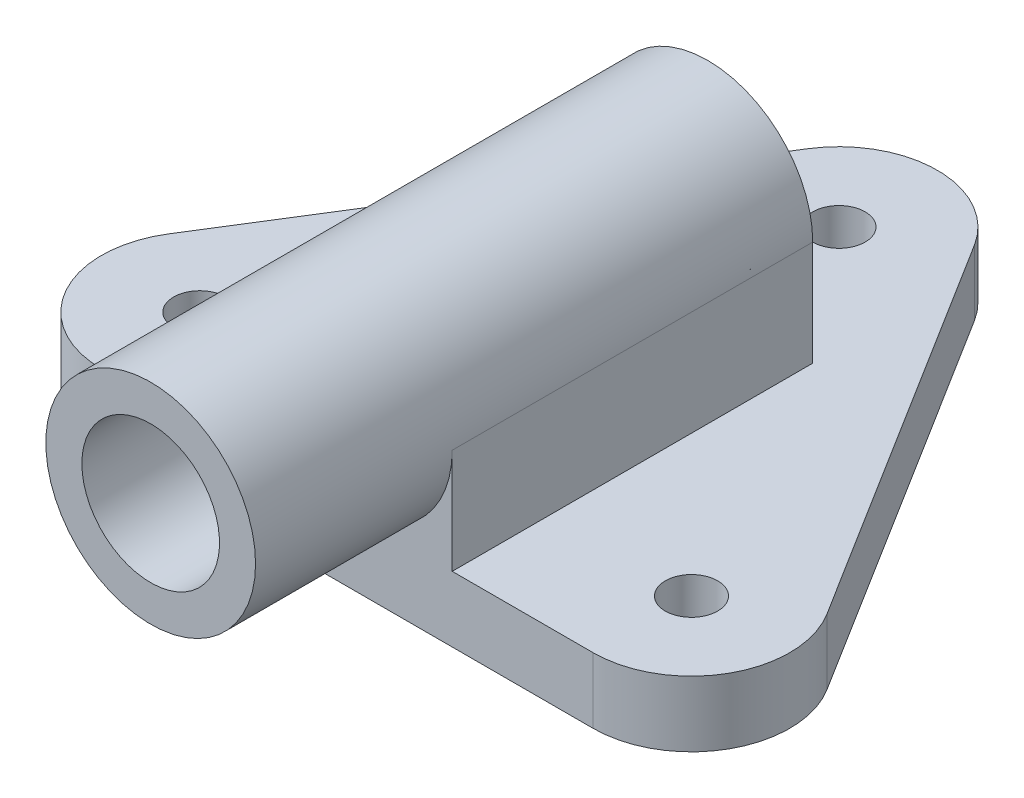
ISO-10303-21;
HEADER;
FILE_DESCRIPTION(('STEP AP214'),'2;1');
FILE_NAME('part.step','',(''),(''),'','','');
FILE_SCHEMA(('AUTOMOTIVE_DESIGN { 1 0 10303 214 1 1 1 1 }'));
ENDSEC;
DATA;
#1=APPLICATION_CONTEXT('core data for automotive mechanical design processes');
#2=APPLICATION_PROTOCOL_DEFINITION('international standard','automotive_design',2000,#1);
#3=PRODUCT_CONTEXT('',#1,'mechanical');
#4=PRODUCT('Part','Part','',(#3));
#5=PRODUCT_RELATED_PRODUCT_CATEGORY('part','',(#4));
#6=PRODUCT_DEFINITION_FORMATION('','',#4);
#7=PRODUCT_DEFINITION_CONTEXT('part definition',#1,'design');
#8=PRODUCT_DEFINITION('design','',#6,#7);
#9=PRODUCT_DEFINITION_SHAPE('','',#8);
#10=(LENGTH_UNIT() NAMED_UNIT(*) SI_UNIT(.MILLI.,.METRE.));
#11=(NAMED_UNIT(*) PLANE_ANGLE_UNIT() SI_UNIT($,.RADIAN.));
#12=(NAMED_UNIT(*) SI_UNIT($,.STERADIAN.) SOLID_ANGLE_UNIT());
#13=UNCERTAINTY_MEASURE_WITH_UNIT(LENGTH_MEASURE(1.E-05),#10,'distance_accuracy_value','');
#14=(GEOMETRIC_REPRESENTATION_CONTEXT(3) GLOBAL_UNCERTAINTY_ASSIGNED_CONTEXT((#13)) GLOBAL_UNIT_ASSIGNED_CONTEXT((#10,
#11,#12)) REPRESENTATION_CONTEXT('',''));
#15=CARTESIAN_POINT('',(0.,0.,0.));
#16=DIRECTION('',(0.,0.,1.));
#17=DIRECTION('',(1.,0.,0.));
#18=AXIS2_PLACEMENT_3D('',#15,#16,#17);
#19=CARTESIAN_POINT('',(0.,26.,105.));
#20=DIRECTION('',(0.,0.,1.));
#21=DIRECTION('',(1.,0.,0.));
#22=AXIS2_PLACEMENT_3D('',#19,#20,#21);
#23=PLANE('',#22);
#24=CARTESIAN_POINT('',(0.,26.,105.));
#25=DIRECTION('',(0.,0.,-1.));
#26=DIRECTION('',(-1.,0.,0.));
#27=AXIS2_PLACEMENT_3D('',#24,#25,#26);
#28=CIRCLE('',#27,10.5);
#29=CARTESIAN_POINT('',(-10.5,26.,105.));
#30=VERTEX_POINT('',#29);
#31=EDGE_CURVE('E248',#30,#30,#28,.T.);
#32=ORIENTED_EDGE('',*,*,#31,.T.);
#33=EDGE_LOOP('',(#32));
#34=FACE_BOUND('',#33,.T.);
#35=CARTESIAN_POINT('',(0.,26.,105.));
#36=DIRECTION('',(0.,0.,1.));
#37=DIRECTION('',(1.,0.,0.));
#38=AXIS2_PLACEMENT_3D('',#35,#36,#37);
#39=CIRCLE('',#38,16.);
#40=CARTESIAN_POINT('',(16.,26.,105.));
#41=VERTEX_POINT('',#40);
#42=EDGE_CURVE('E259',#41,#41,#39,.T.);
#43=ORIENTED_EDGE('',*,*,#42,.T.);
#44=EDGE_LOOP('',(#43));
#45=FACE_BOUND('',#44,.T.);
#46=ADVANCED_FACE('F61',(#34,#45),#23,.T.);
#47=CARTESIAN_POINT('',(-16.,10.,105.));
#48=DIRECTION('',(1.,0.,0.));
#49=DIRECTION('',(0.,0.,-1.));
#50=AXIS2_PLACEMENT_3D('',#47,#48,#49);
#51=PLANE('',#50);
#52=DIRECTION('',(0.,-1.,0.));
#53=VECTOR('',#52,1.);
#54=CARTESIAN_POINT('',(-16.,0.,75.));
#55=LINE('',#54,#53);
#56=CARTESIAN_POINT('',(-16.,26.,75.));
#57=VERTEX_POINT('',#56);
#58=CARTESIAN_POINT('',(-16.,10.,75.));
#59=VERTEX_POINT('',#58);
#60=EDGE_CURVE('E139',#57,#59,#55,.T.);
#61=ORIENTED_EDGE('',*,*,#60,.F.);
#62=DIRECTION('',(0.,0.,-1.));
#63=VECTOR('',#62,1.);
#64=CARTESIAN_POINT('',(-16.,26.,105.));
#65=LINE('',#64,#63);
#66=CARTESIAN_POINT('',(-16.,26.,20.));
#67=VERTEX_POINT('',#66);
#68=EDGE_CURVE('E258',#57,#67,#65,.T.);
#69=ORIENTED_EDGE('',*,*,#68,.T.);
#70=DIRECTION('',(0.,-1.,0.));
#71=VECTOR('',#70,1.);
#72=CARTESIAN_POINT('',(-16.,10.,20.));
#73=LINE('',#72,#71);
#74=CARTESIAN_POINT('',(-16.,10.,20.));
#75=VERTEX_POINT('',#74);
#76=EDGE_CURVE('E152',#67,#75,#73,.T.);
#77=ORIENTED_EDGE('',*,*,#76,.T.);
#78=DIRECTION('',(0.,0.,-1.));
#79=VECTOR('',#78,1.);
#80=CARTESIAN_POINT('',(-16.,10.,105.));
#81=LINE('',#80,#79);
#82=EDGE_CURVE('E71',#59,#75,#81,.T.);
#83=ORIENTED_EDGE('',*,*,#82,.F.);
#84=EDGE_LOOP('',(#61,#69,#77,#83));
#85=FACE_BOUND('',#84,.T.);
#86=ADVANCED_FACE('F151',(#85),#51,.F.);
#87=CARTESIAN_POINT('',(16.,26.,105.));
#88=DIRECTION('',(-1.,0.,0.));
#89=DIRECTION('',(0.,0.,1.));
#90=AXIS2_PLACEMENT_3D('',#87,#88,#89);
#91=PLANE('',#90);
#92=DIRECTION('',(0.,1.,0.));
#93=VECTOR('',#92,1.);
#94=CARTESIAN_POINT('',(16.,0.,75.));
#95=LINE('',#94,#93);
#96=CARTESIAN_POINT('',(16.,10.,75.));
#97=VERTEX_POINT('',#96);
#98=CARTESIAN_POINT('',(16.,26.,75.));
#99=VERTEX_POINT('',#98);
#100=EDGE_CURVE('E244',#97,#99,#95,.T.);
#101=ORIENTED_EDGE('',*,*,#100,.F.);
#102=DIRECTION('',(0.,0.,-1.));
#103=VECTOR('',#102,1.);
#104=CARTESIAN_POINT('',(16.,10.,105.));
#105=LINE('',#104,#103);
#106=CARTESIAN_POINT('',(16.,10.,20.));
#107=VERTEX_POINT('',#106);
#108=EDGE_CURVE('E12',#97,#107,#105,.T.);
#109=ORIENTED_EDGE('',*,*,#108,.T.);
#110=DIRECTION('',(0.,1.,0.));
#111=VECTOR('',#110,1.);
#112=CARTESIAN_POINT('',(16.,26.,20.));
#113=LINE('',#112,#111);
#114=CARTESIAN_POINT('',(16.,26.,20.));
#115=VERTEX_POINT('',#114);
#116=EDGE_CURVE('E253',#107,#115,#113,.T.);
#117=ORIENTED_EDGE('',*,*,#116,.T.);
#118=DIRECTION('',(0.,0.,-1.));
#119=VECTOR('',#118,1.);
#120=CARTESIAN_POINT('',(16.,26.,105.));
#121=LINE('',#120,#119);
#122=EDGE_CURVE('E251',#99,#115,#121,.T.);
#123=ORIENTED_EDGE('',*,*,#122,.F.);
#124=EDGE_LOOP('',(#101,#109,#117,#123));
#125=FACE_BOUND('',#124,.T.);
#126=ADVANCED_FACE('F252',(#125),#91,.F.);
#127=CARTESIAN_POINT('',(-37.5,10.,60.));
#128=DIRECTION('',(0.,1.,0.));
#129=DIRECTION('',(0.,0.,1.));
#130=AXIS2_PLACEMENT_3D('',#127,#128,#129);
#131=PLANE('',#130);
#132=ORIENTED_EDGE('',*,*,#108,.F.);
#133=DIRECTION('',(1.,0.,0.));
#134=VECTOR('',#133,1.);
#135=CARTESIAN_POINT('',(37.5,10.,75.));
#136=LINE('',#135,#134);
#137=CARTESIAN_POINT('',(37.5,10.,75.));
#138=VERTEX_POINT('',#137);
#139=EDGE_CURVE('E165',#97,#138,#136,.T.);
#140=ORIENTED_EDGE('',*,*,#139,.T.);
#141=CARTESIAN_POINT('',(37.5,10.,60.));
#142=DIRECTION('',(0.,1.,0.));
#143=DIRECTION('',(0.,0.,1.));
#144=AXIS2_PLACEMENT_3D('',#141,#142,#143);
#145=CIRCLE('',#144,15.);
#146=CARTESIAN_POINT('',(50.2199745600763,10.,52.0500158999523));
#147=VERTEX_POINT('',#146);
#148=EDGE_CURVE('E164',#138,#147,#145,.T.);
#149=ORIENTED_EDGE('',*,*,#148,.T.);
#150=DIRECTION('',(-0.52999894000318,0.,-0.847998304005088));
#151=VECTOR('',#150,1.);
#152=CARTESIAN_POINT('',(12.7199745600763,10.,-7.9499841000477));
#153=LINE('',#152,#151);
#154=CARTESIAN_POINT('',(12.7199745600763,10.,-7.9499841000477));
#155=VERTEX_POINT('',#154);
#156=EDGE_CURVE('E169',#147,#155,#153,.T.);
#157=ORIENTED_EDGE('',*,*,#156,.T.);
#158=CARTESIAN_POINT('',(0.,10.,0.));
#159=DIRECTION('',(0.,1.,0.));
#160=DIRECTION('',(0.,0.,1.));
#161=AXIS2_PLACEMENT_3D('',#158,#159,#160);
#162=CIRCLE('',#161,15.);
#163=CARTESIAN_POINT('',(-12.7199745600763,10.,-7.94998410004769));
#164=VERTEX_POINT('',#163);
#165=EDGE_CURVE('E176',#155,#164,#162,.T.);
#166=ORIENTED_EDGE('',*,*,#165,.T.);
#167=DIRECTION('',(-0.52999894000318,0.,0.847998304005088));
#168=VECTOR('',#167,1.);
#169=CARTESIAN_POINT('',(-50.2199745600763,10.,52.0500158999523));
#170=LINE('',#169,#168);
#171=CARTESIAN_POINT('',(-50.2199745600763,10.,52.0500158999523));
#172=VERTEX_POINT('',#171);
#173=EDGE_CURVE('E179',#164,#172,#170,.T.);
#174=ORIENTED_EDGE('',*,*,#173,.T.);
#175=CARTESIAN_POINT('',(-37.5,10.,60.));
#176=DIRECTION('',(0.,1.,0.));
#177=DIRECTION('',(0.,0.,1.));
#178=AXIS2_PLACEMENT_3D('',#175,#176,#177);
#179=CIRCLE('',#178,15.);
#180=CARTESIAN_POINT('',(-37.5,10.,75.));
#181=VERTEX_POINT('',#180);
#182=EDGE_CURVE('E161',#172,#181,#179,.T.);
#183=ORIENTED_EDGE('',*,*,#182,.T.);
#184=EDGE_CURVE('E144',#181,#59,#136,.T.);
#185=ORIENTED_EDGE('',*,*,#184,.T.);
#186=ORIENTED_EDGE('',*,*,#82,.T.);
#187=DIRECTION('',(1.,0.,0.));
#188=VECTOR('',#187,1.);
#189=CARTESIAN_POINT('',(16.,10.,20.));
#190=LINE('',#189,#188);
#191=EDGE_CURVE('E87',#75,#107,#190,.T.);
#192=ORIENTED_EDGE('',*,*,#191,.T.);
#193=EDGE_LOOP('',(#132,#140,#149,#157,#166,#174,#183,#185,#186,#192));
#194=FACE_BOUND('',#193,.T.);
#195=CARTESIAN_POINT('',(-37.5,10.,60.));
#196=DIRECTION('',(0.,1.,0.));
#197=DIRECTION('',(0.,0.,1.));
#198=AXIS2_PLACEMENT_3D('',#195,#196,#197);
#199=CIRCLE('',#198,4.00000000000001);
#200=CARTESIAN_POINT('',(-37.5,10.,64.));
#201=VERTEX_POINT('',#200);
#202=EDGE_CURVE('E278',#201,#201,#199,.T.);
#203=ORIENTED_EDGE('',*,*,#202,.F.);
#204=EDGE_LOOP('',(#203));
#205=FACE_BOUND('',#204,.T.);
#206=CARTESIAN_POINT('',(0.,10.,0.));
#207=DIRECTION('',(0.,1.,0.));
#208=DIRECTION('',(0.,0.,1.));
#209=AXIS2_PLACEMENT_3D('',#206,#207,#208);
#210=CIRCLE('',#209,4.);
#211=CARTESIAN_POINT('',(0.,10.,4.));
#212=VERTEX_POINT('',#211);
#213=EDGE_CURVE('E188',#212,#212,#210,.T.);
#214=ORIENTED_EDGE('',*,*,#213,.F.);
#215=EDGE_LOOP('',(#214));
#216=FACE_BOUND('',#215,.T.);
#217=CARTESIAN_POINT('',(37.5,10.,60.));
#218=DIRECTION('',(0.,1.,0.));
#219=DIRECTION('',(0.,0.,1.));
#220=AXIS2_PLACEMENT_3D('',#217,#218,#219);
#221=CIRCLE('',#220,4.00000000000001);
#222=CARTESIAN_POINT('',(37.5,10.,64.));
#223=VERTEX_POINT('',#222);
#224=EDGE_CURVE('E270',#223,#223,#221,.T.);
#225=ORIENTED_EDGE('',*,*,#224,.F.);
#226=EDGE_LOOP('',(#225));
#227=FACE_BOUND('',#226,.T.);
#228=ADVANCED_FACE('F158',(#194,#205,#216,#227),#131,.T.);
#229=CARTESIAN_POINT('',(-37.5,0.,60.));
#230=DIRECTION('',(0.,1.,0.));
#231=DIRECTION('',(0.,0.,1.));
#232=AXIS2_PLACEMENT_3D('',#229,#230,#231);
#233=PLANE('',#232);
#234=CARTESIAN_POINT('',(-37.5,0.,60.));
#235=DIRECTION('',(0.,1.,0.));
#236=DIRECTION('',(0.,0.,1.));
#237=AXIS2_PLACEMENT_3D('',#234,#235,#236);
#238=CIRCLE('',#237,15.);
#239=CARTESIAN_POINT('',(-50.2199745600763,0.,52.0500158999523));
#240=VERTEX_POINT('',#239);
#241=CARTESIAN_POINT('',(-37.5,0.,75.));
#242=VERTEX_POINT('',#241);
#243=EDGE_CURVE('E183',#240,#242,#238,.T.);
#244=ORIENTED_EDGE('',*,*,#243,.F.);
#245=DIRECTION('',(-0.52999894000318,0.,0.847998304005088));
#246=VECTOR('',#245,1.);
#247=CARTESIAN_POINT('',(-50.2199745600763,0.,52.0500158999523));
#248=LINE('',#247,#246);
#249=CARTESIAN_POINT('',(-12.7199745600763,0.,-7.94998410004769));
#250=VERTEX_POINT('',#249);
#251=EDGE_CURVE('E200',#250,#240,#248,.T.);
#252=ORIENTED_EDGE('',*,*,#251,.F.);
#253=CARTESIAN_POINT('',(0.,0.,0.));
#254=DIRECTION('',(0.,1.,0.));
#255=DIRECTION('',(0.,0.,1.));
#256=AXIS2_PLACEMENT_3D('',#253,#254,#255);
#257=CIRCLE('',#256,15.);
#258=CARTESIAN_POINT('',(12.7199745600763,0.,-7.9499841000477));
#259=VERTEX_POINT('',#258);
#260=EDGE_CURVE('E197',#259,#250,#257,.T.);
#261=ORIENTED_EDGE('',*,*,#260,.F.);
#262=DIRECTION('',(-0.52999894000318,0.,-0.847998304005088));
#263=VECTOR('',#262,1.);
#264=CARTESIAN_POINT('',(12.7199745600763,0.,-7.9499841000477));
#265=LINE('',#264,#263);
#266=CARTESIAN_POINT('',(50.2199745600763,0.,52.0500158999523));
#267=VERTEX_POINT('',#266);
#268=EDGE_CURVE('E194',#267,#259,#265,.T.);
#269=ORIENTED_EDGE('',*,*,#268,.F.);
#270=CARTESIAN_POINT('',(37.5,0.,60.));
#271=DIRECTION('',(0.,1.,0.));
#272=DIRECTION('',(0.,0.,1.));
#273=AXIS2_PLACEMENT_3D('',#270,#271,#272);
#274=CIRCLE('',#273,15.);
#275=CARTESIAN_POINT('',(37.5,0.,75.));
#276=VERTEX_POINT('',#275);
#277=EDGE_CURVE('E191',#276,#267,#274,.T.);
#278=ORIENTED_EDGE('',*,*,#277,.F.);
#279=DIRECTION('',(1.,0.,0.));
#280=VECTOR('',#279,1.);
#281=CARTESIAN_POINT('',(37.5,0.,75.));
#282=LINE('',#281,#280);
#283=EDGE_CURVE('E187',#242,#276,#282,.T.);
#284=ORIENTED_EDGE('',*,*,#283,.F.);
#285=EDGE_LOOP('',(#244,#252,#261,#269,#278,#284));
#286=FACE_BOUND('',#285,.T.);
#287=CARTESIAN_POINT('',(0.,0.,0.));
#288=DIRECTION('',(0.,1.,0.));
#289=DIRECTION('',(0.,0.,1.));
#290=AXIS2_PLACEMENT_3D('',#287,#288,#289);
#291=CIRCLE('',#290,4.);
#292=CARTESIAN_POINT('',(0.,0.,4.));
#293=VERTEX_POINT('',#292);
#294=EDGE_CURVE('E282',#293,#293,#291,.T.);
#295=ORIENTED_EDGE('',*,*,#294,.T.);
#296=EDGE_LOOP('',(#295));
#297=FACE_BOUND('',#296,.T.);
#298=CARTESIAN_POINT('',(-37.5,0.,60.));
#299=DIRECTION('',(0.,1.,0.));
#300=DIRECTION('',(0.,0.,1.));
#301=AXIS2_PLACEMENT_3D('',#298,#299,#300);
#302=CIRCLE('',#301,4.00000000000001);
#303=CARTESIAN_POINT('',(-37.5,0.,64.));
#304=VERTEX_POINT('',#303);
#305=EDGE_CURVE('E274',#304,#304,#302,.T.);
#306=ORIENTED_EDGE('',*,*,#305,.T.);
#307=EDGE_LOOP('',(#306));
#308=FACE_BOUND('',#307,.T.);
#309=CARTESIAN_POINT('',(37.5,0.,60.));
#310=DIRECTION('',(0.,1.,0.));
#311=DIRECTION('',(0.,0.,1.));
#312=AXIS2_PLACEMENT_3D('',#309,#310,#311);
#313=CIRCLE('',#312,4.00000000000001);
#314=CARTESIAN_POINT('',(37.5,0.,64.));
#315=VERTEX_POINT('',#314);
#316=EDGE_CURVE('E263',#315,#315,#313,.T.);
#317=ORIENTED_EDGE('',*,*,#316,.T.);
#318=EDGE_LOOP('',(#317));
#319=FACE_BOUND('',#318,.T.);
#320=ADVANCED_FACE('F228',(#286,#297,#308,#319),#233,.F.);
#321=CARTESIAN_POINT('',(-37.5,10.,60.));
#322=DIRECTION('',(0.,-1.,0.));
#323=DIRECTION('',(0.,0.,-1.));
#324=AXIS2_PLACEMENT_3D('',#321,#322,#323);
#325=CYLINDRICAL_SURFACE('',#324,15.);
#326=ORIENTED_EDGE('',*,*,#243,.T.);
#327=DIRECTION('',(0.,-1.,0.));
#328=VECTOR('',#327,1.);
#329=CARTESIAN_POINT('',(-37.5,10.,75.));
#330=LINE('',#329,#328);
#331=EDGE_CURVE('E155',#181,#242,#330,.T.);
#332=ORIENTED_EDGE('',*,*,#331,.F.);
#333=ORIENTED_EDGE('',*,*,#182,.F.);
#334=DIRECTION('',(0.,-1.,0.));
#335=VECTOR('',#334,1.);
#336=CARTESIAN_POINT('',(-50.2199745600763,10.,52.0500158999523));
#337=LINE('',#336,#335);
#338=EDGE_CURVE('E182',#172,#240,#337,.T.);
#339=ORIENTED_EDGE('',*,*,#338,.T.);
#340=EDGE_LOOP('',(#326,#332,#333,#339));
#341=FACE_BOUND('',#340,.T.);
#342=ADVANCED_FACE('F63',(#341),#325,.T.);
#343=CARTESIAN_POINT('',(37.5,10.,75.));
#344=DIRECTION('',(0.,0.,-1.));
#345=DIRECTION('',(-1.,0.,0.));
#346=AXIS2_PLACEMENT_3D('',#343,#344,#345);
#347=PLANE('',#346);
#348=ORIENTED_EDGE('',*,*,#283,.T.);
#349=DIRECTION('',(0.,-1.,0.));
#350=VECTOR('',#349,1.);
#351=CARTESIAN_POINT('',(37.5,10.,75.));
#352=LINE('',#351,#350);
#353=EDGE_CURVE('E218',#138,#276,#352,.T.);
#354=ORIENTED_EDGE('',*,*,#353,.F.);
#355=ORIENTED_EDGE('',*,*,#139,.F.);
#356=ORIENTED_EDGE('',*,*,#100,.T.);
#357=CARTESIAN_POINT('',(0.,26.,75.));
#358=DIRECTION('',(0.,0.,1.));
#359=DIRECTION('',(1.,0.,0.));
#360=AXIS2_PLACEMENT_3D('',#357,#358,#359);
#361=CIRCLE('',#360,16.);
#362=EDGE_CURVE('E79',#57,#99,#361,.T.);
#363=ORIENTED_EDGE('',*,*,#362,.F.);
#364=ORIENTED_EDGE('',*,*,#60,.T.);
#365=ORIENTED_EDGE('',*,*,#184,.F.);
#366=ORIENTED_EDGE('',*,*,#331,.T.);
#367=EDGE_LOOP('',(#348,#354,#355,#356,#363,#364,#365,#366));
#368=FACE_BOUND('',#367,.T.);
#369=ADVANCED_FACE('F141',(#368),#347,.F.);
#370=CARTESIAN_POINT('',(37.5,10.,60.));
#371=DIRECTION('',(0.,-1.,0.));
#372=DIRECTION('',(0.,0.,-1.));
#373=AXIS2_PLACEMENT_3D('',#370,#371,#372);
#374=CYLINDRICAL_SURFACE('',#373,15.);
#375=ORIENTED_EDGE('',*,*,#277,.T.);
#376=DIRECTION('',(0.,-1.,0.));
#377=VECTOR('',#376,1.);
#378=CARTESIAN_POINT('',(50.2199745600763,10.,52.0500158999523));
#379=LINE('',#378,#377);
#380=EDGE_CURVE('E214',#147,#267,#379,.T.);
#381=ORIENTED_EDGE('',*,*,#380,.F.);
#382=ORIENTED_EDGE('',*,*,#148,.F.);
#383=ORIENTED_EDGE('',*,*,#353,.T.);
#384=EDGE_LOOP('',(#375,#381,#382,#383));
#385=FACE_BOUND('',#384,.T.);
#386=ADVANCED_FACE('F235',(#385),#374,.T.);
#387=CARTESIAN_POINT('',(12.7199745600763,10.,-7.9499841000477));
#388=DIRECTION('',(-0.847998304005088,0.,0.52999894000318));
#389=DIRECTION('',(0.52999894000318,0.,0.847998304005088));
#390=AXIS2_PLACEMENT_3D('',#387,#388,#389);
#391=PLANE('',#390);
#392=ORIENTED_EDGE('',*,*,#268,.T.);
#393=DIRECTION('',(0.,-1.,0.));
#394=VECTOR('',#393,1.);
#395=CARTESIAN_POINT('',(12.7199745600763,10.,-7.9499841000477));
#396=LINE('',#395,#394);
#397=EDGE_CURVE('E210',#155,#259,#396,.T.);
#398=ORIENTED_EDGE('',*,*,#397,.F.);
#399=ORIENTED_EDGE('',*,*,#156,.F.);
#400=ORIENTED_EDGE('',*,*,#380,.T.);
#401=EDGE_LOOP('',(#392,#398,#399,#400));
#402=FACE_BOUND('',#401,.T.);
#403=ADVANCED_FACE('F239',(#402),#391,.F.);
#404=CARTESIAN_POINT('',(0.,10.,0.));
#405=DIRECTION('',(0.,-1.,0.));
#406=DIRECTION('',(0.,0.,-1.));
#407=AXIS2_PLACEMENT_3D('',#404,#405,#406);
#408=CYLINDRICAL_SURFACE('',#407,15.);
#409=ORIENTED_EDGE('',*,*,#260,.T.);
#410=DIRECTION('',(0.,-1.,0.));
#411=VECTOR('',#410,1.);
#412=CARTESIAN_POINT('',(-12.7199745600763,10.,-7.94998410004769));
#413=LINE('',#412,#411);
#414=EDGE_CURVE('E206',#164,#250,#413,.T.);
#415=ORIENTED_EDGE('',*,*,#414,.F.);
#416=ORIENTED_EDGE('',*,*,#165,.F.);
#417=ORIENTED_EDGE('',*,*,#397,.T.);
#418=EDGE_LOOP('',(#409,#415,#416,#417));
#419=FACE_BOUND('',#418,.T.);
#420=ADVANCED_FACE('F306',(#419),#408,.T.);
#421=CARTESIAN_POINT('',(-50.2199745600763,10.,52.0500158999523));
#422=DIRECTION('',(0.847998304005088,0.,0.52999894000318));
#423=DIRECTION('',(0.52999894000318,0.,-0.847998304005088));
#424=AXIS2_PLACEMENT_3D('',#421,#422,#423);
#425=PLANE('',#424);
#426=ORIENTED_EDGE('',*,*,#251,.T.);
#427=ORIENTED_EDGE('',*,*,#338,.F.);
#428=ORIENTED_EDGE('',*,*,#173,.F.);
#429=ORIENTED_EDGE('',*,*,#414,.T.);
#430=EDGE_LOOP('',(#426,#427,#428,#429));
#431=FACE_BOUND('',#430,.T.);
#432=ADVANCED_FACE('F296',(#431),#425,.F.);
#433=CARTESIAN_POINT('',(0.,10.,0.));
#434=DIRECTION('',(0.,-1.,0.));
#435=DIRECTION('',(0.,0.,-1.));
#436=AXIS2_PLACEMENT_3D('',#433,#434,#435);
#437=CYLINDRICAL_SURFACE('',#436,4.);
#438=ORIENTED_EDGE('',*,*,#213,.T.);
#439=EDGE_LOOP('',(#438));
#440=FACE_BOUND('',#439,.T.);
#441=ORIENTED_EDGE('',*,*,#294,.F.);
#442=EDGE_LOOP('',(#441));
#443=FACE_BOUND('',#442,.T.);
#444=ADVANCED_FACE('F293',(#440,#443),#437,.F.);
#445=CARTESIAN_POINT('',(-37.5,10.,60.));
#446=DIRECTION('',(0.,-1.,0.));
#447=DIRECTION('',(0.,0.,-1.));
#448=AXIS2_PLACEMENT_3D('',#445,#446,#447);
#449=CYLINDRICAL_SURFACE('',#448,4.00000000000001);
#450=ORIENTED_EDGE('',*,*,#202,.T.);
#451=EDGE_LOOP('',(#450));
#452=FACE_BOUND('',#451,.T.);
#453=ORIENTED_EDGE('',*,*,#305,.F.);
#454=EDGE_LOOP('',(#453));
#455=FACE_BOUND('',#454,.T.);
#456=ADVANCED_FACE('F295',(#452,#455),#449,.F.);
#457=CARTESIAN_POINT('',(37.5,10.,60.));
#458=DIRECTION('',(0.,-1.,0.));
#459=DIRECTION('',(0.,0.,-1.));
#460=AXIS2_PLACEMENT_3D('',#457,#458,#459);
#461=CYLINDRICAL_SURFACE('',#460,4.00000000000001);
#462=ORIENTED_EDGE('',*,*,#224,.T.);
#463=EDGE_LOOP('',(#462));
#464=FACE_BOUND('',#463,.T.);
#465=ORIENTED_EDGE('',*,*,#316,.F.);
#466=EDGE_LOOP('',(#465));
#467=FACE_BOUND('',#466,.T.);
#468=ADVANCED_FACE('F303',(#464,#467),#461,.F.);
#469=CARTESIAN_POINT('',(0.,26.,105.));
#470=DIRECTION('',(0.,0.,-1.));
#471=DIRECTION('',(-1.,0.,0.));
#472=AXIS2_PLACEMENT_3D('',#469,#470,#471);
#473=CYLINDRICAL_SURFACE('',#472,16.);
#474=ORIENTED_EDGE('',*,*,#42,.F.);
#475=EDGE_LOOP('',(#474));
#476=FACE_BOUND('',#475,.T.);
#477=CARTESIAN_POINT('',(0.,26.,20.));
#478=DIRECTION('',(0.,0.,1.));
#479=DIRECTION('',(1.,0.,0.));
#480=AXIS2_PLACEMENT_3D('',#477,#478,#479);
#481=CIRCLE('',#480,16.);
#482=EDGE_CURVE('E498',#115,#67,#481,.T.);
#483=ORIENTED_EDGE('',*,*,#482,.T.);
#484=ORIENTED_EDGE('',*,*,#68,.F.);
#485=ORIENTED_EDGE('',*,*,#362,.T.);
#486=ORIENTED_EDGE('',*,*,#122,.T.);
#487=EDGE_LOOP('',(#483,#484,#485,#486));
#488=FACE_BOUND('',#487,.T.);
#489=ADVANCED_FACE('F325',(#476,#488),#473,.T.);
#490=CARTESIAN_POINT('',(0.,26.,20.));
#491=DIRECTION('',(0.,0.,1.));
#492=DIRECTION('',(1.,0.,0.));
#493=AXIS2_PLACEMENT_3D('',#490,#491,#492);
#494=PLANE('',#493);
#495=CARTESIAN_POINT('',(0.,26.,20.));
#496=DIRECTION('',(0.,0.,1.));
#497=DIRECTION('',(1.,0.,0.));
#498=AXIS2_PLACEMENT_3D('',#495,#496,#497);
#499=CIRCLE('',#498,10.5);
#500=CARTESIAN_POINT('',(10.5,26.,20.));
#501=VERTEX_POINT('',#500);
#502=EDGE_CURVE('E65',#501,#501,#499,.T.);
#503=ORIENTED_EDGE('',*,*,#502,.T.);
#504=EDGE_LOOP('',(#503));
#505=FACE_BOUND('',#504,.T.);
#506=ORIENTED_EDGE('',*,*,#482,.F.);
#507=ORIENTED_EDGE('',*,*,#116,.F.);
#508=ORIENTED_EDGE('',*,*,#191,.F.);
#509=ORIENTED_EDGE('',*,*,#76,.F.);
#510=EDGE_LOOP('',(#506,#507,#508,#509));
#511=FACE_BOUND('',#510,.T.);
#512=ADVANCED_FACE('F322',(#505,#511),#494,.F.);
#513=CARTESIAN_POINT('',(0.,26.,105.));
#514=DIRECTION('',(0.,0.,-1.));
#515=DIRECTION('',(-1.,0.,0.));
#516=AXIS2_PLACEMENT_3D('',#513,#514,#515);
#517=CYLINDRICAL_SURFACE('',#516,10.5);
#518=ORIENTED_EDGE('',*,*,#31,.F.);
#519=EDGE_LOOP('',(#518));
#520=FACE_BOUND('',#519,.T.);
#521=ORIENTED_EDGE('',*,*,#502,.F.);
#522=EDGE_LOOP('',(#521));
#523=FACE_BOUND('',#522,.T.);
#524=ADVANCED_FACE('F321',(#520,#523),#517,.F.);
#525=CLOSED_SHELL('',(#46,#86,#126,#228,#320,#342,#369,#386,#403,#420,#432,#444,#456,#468,#489,
#512,#524));
#526=MANIFOLD_SOLID_BREP('B2',#525);
#527=ADVANCED_BREP_SHAPE_REPRESENTATION('',(#18,#526),#14);
#528=SHAPE_DEFINITION_REPRESENTATION(#9,#527);
ENDSEC;
END-ISO-10303-21;
